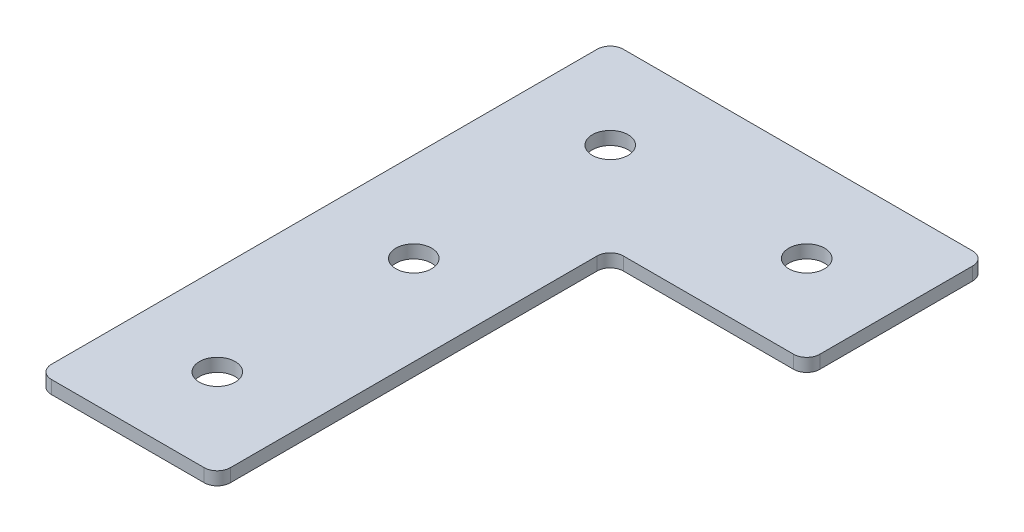
ISO-10303-21;
HEADER;
FILE_DESCRIPTION(('STEP AP214'),'2;1');
FILE_NAME('part.step','',(''),(''),'','','');
FILE_SCHEMA(('AUTOMOTIVE_DESIGN { 1 0 10303 214 1 1 1 1 }'));
ENDSEC;
DATA;
#1=APPLICATION_CONTEXT('core data for automotive mechanical design processes');
#2=APPLICATION_PROTOCOL_DEFINITION('international standard','automotive_design',2000,#1);
#3=PRODUCT_CONTEXT('',#1,'mechanical');
#4=PRODUCT('Part','Part','',(#3));
#5=PRODUCT_RELATED_PRODUCT_CATEGORY('part','',(#4));
#6=PRODUCT_DEFINITION_FORMATION('','',#4);
#7=PRODUCT_DEFINITION_CONTEXT('part definition',#1,'design');
#8=PRODUCT_DEFINITION('design','',#6,#7);
#9=PRODUCT_DEFINITION_SHAPE('','',#8);
#10=(LENGTH_UNIT() NAMED_UNIT(*) SI_UNIT(.MILLI.,.METRE.));
#11=(NAMED_UNIT(*) PLANE_ANGLE_UNIT() SI_UNIT($,.RADIAN.));
#12=(NAMED_UNIT(*) SI_UNIT($,.STERADIAN.) SOLID_ANGLE_UNIT());
#13=UNCERTAINTY_MEASURE_WITH_UNIT(LENGTH_MEASURE(1.E-05),#10,'distance_accuracy_value','');
#14=(GEOMETRIC_REPRESENTATION_CONTEXT(3) GLOBAL_UNCERTAINTY_ASSIGNED_CONTEXT((#13)) GLOBAL_UNIT_ASSIGNED_CONTEXT((#10,
#11,#12)) REPRESENTATION_CONTEXT('',''));
#15=CARTESIAN_POINT('',(0.,0.,0.));
#16=DIRECTION('',(0.,0.,1.));
#17=DIRECTION('',(1.,0.,0.));
#18=AXIS2_PLACEMENT_3D('',#15,#16,#17);
#19=CARTESIAN_POINT('',(-24.170116495859,1.64126526075142,-46.4706382626173));
#20=DIRECTION('',(0.,-1.,0.));
#21=DIRECTION('',(0.,0.,-1.));
#22=AXIS2_PLACEMENT_3D('',#19,#20,#21);
#23=PLANE('',#22);
#24=CARTESIAN_POINT('',(-24.170116495859,1.64126526075142,43.5293617373827));
#25=DIRECTION('',(0.,1.,0.));
#26=DIRECTION('',(0.,0.,1.));
#27=AXIS2_PLACEMENT_3D('',#24,#25,#26);
#28=CIRCLE('',#27,4.1);
#29=CARTESIAN_POINT('',(-24.170116495859,1.64126526075142,47.6293617373827));
#30=VERTEX_POINT('',#29);
#31=EDGE_CURVE('E323',#30,#30,#28,.T.);
#32=ORIENTED_EDGE('',*,*,#31,.T.);
#33=EDGE_LOOP('',(#32));
#34=FACE_BOUND('',#33,.T.);
#35=CARTESIAN_POINT('',(-24.170116495859,1.64126526075142,-1.47063826261726));
#36=DIRECTION('',(0.,1.,0.));
#37=DIRECTION('',(0.,0.,1.));
#38=AXIS2_PLACEMENT_3D('',#35,#36,#37);
#39=CIRCLE('',#38,4.1);
#40=CARTESIAN_POINT('',(-24.170116495859,1.64126526075142,2.62936173738274));
#41=VERTEX_POINT('',#40);
#42=EDGE_CURVE('E319',#41,#41,#39,.T.);
#43=ORIENTED_EDGE('',*,*,#42,.T.);
#44=EDGE_LOOP('',(#43));
#45=FACE_BOUND('',#44,.T.);
#46=CARTESIAN_POINT('',(20.829883504141,1.64126526075142,-46.4706382626172));
#47=DIRECTION('',(0.,1.,0.));
#48=DIRECTION('',(0.,0.,1.));
#49=AXIS2_PLACEMENT_3D('',#46,#47,#48);
#50=CIRCLE('',#49,4.1);
#51=CARTESIAN_POINT('',(20.829883504141,1.64126526075142,-42.3706382626172));
#52=VERTEX_POINT('',#51);
#53=EDGE_CURVE('E313',#52,#52,#50,.T.);
#54=ORIENTED_EDGE('',*,*,#53,.T.);
#55=EDGE_LOOP('',(#54));
#56=FACE_BOUND('',#55,.T.);
#57=CARTESIAN_POINT('',(-24.170116495859,1.64126526075142,-46.4706382626173));
#58=DIRECTION('',(0.,1.,0.));
#59=DIRECTION('',(0.,0.,1.));
#60=AXIS2_PLACEMENT_3D('',#57,#58,#59);
#61=CIRCLE('',#60,4.1);
#62=CARTESIAN_POINT('',(-24.170116495859,1.64126526075142,-42.3706382626173));
#63=VERTEX_POINT('',#62);
#64=EDGE_CURVE('E187',#63,#63,#61,.T.);
#65=ORIENTED_EDGE('',*,*,#64,.T.);
#66=EDGE_LOOP('',(#65));
#67=FACE_BOUND('',#66,.T.);
#68=DIRECTION('',(-1.,0.,0.));
#69=VECTOR('',#68,1.);
#70=CARTESIAN_POINT('',(41.329883504141,1.64126526075142,-66.9706382626173));
#71=LINE('',#70,#69);
#72=CARTESIAN_POINT('',(38.329883504141,1.64126526075142,-66.9706382626173));
#73=VERTEX_POINT('',#72);
#74=CARTESIAN_POINT('',(-41.670116495859,1.64126526075142,-66.9706382626173));
#75=VERTEX_POINT('',#74);
#76=EDGE_CURVE('E208',#73,#75,#71,.T.);
#77=ORIENTED_EDGE('',*,*,#76,.F.);
#78=CARTESIAN_POINT('',(38.329883504141,1.64126526075142,-63.9706382626173));
#79=DIRECTION('',(0.,-1.,0.));
#80=DIRECTION('',(0.,0.,-1.));
#81=AXIS2_PLACEMENT_3D('',#78,#79,#80);
#82=CIRCLE('',#81,3.);
#83=CARTESIAN_POINT('',(41.329883504141,1.64126526075142,-63.9706382626173));
#84=VERTEX_POINT('',#83);
#85=EDGE_CURVE('E159',#73,#84,#82,.T.);
#86=ORIENTED_EDGE('',*,*,#85,.T.);
#87=DIRECTION('',(0.,0.,-1.));
#88=VECTOR('',#87,1.);
#89=CARTESIAN_POINT('',(41.329883504141,1.64126526075142,-25.9706382626172));
#90=LINE('',#89,#88);
#91=CARTESIAN_POINT('',(41.329883504141,1.64126526075142,-28.9706382626172));
#92=VERTEX_POINT('',#91);
#93=EDGE_CURVE('E217',#92,#84,#90,.T.);
#94=ORIENTED_EDGE('',*,*,#93,.F.);
#95=CARTESIAN_POINT('',(38.329883504141,1.64126526075142,-28.9706382626172));
#96=DIRECTION('',(0.,-1.,0.));
#97=DIRECTION('',(0.,0.,-1.));
#98=AXIS2_PLACEMENT_3D('',#95,#96,#97);
#99=CIRCLE('',#98,3.);
#100=CARTESIAN_POINT('',(38.329883504141,1.64126526075142,-25.9706382626172));
#101=VERTEX_POINT('',#100);
#102=EDGE_CURVE('E131',#92,#101,#99,.T.);
#103=ORIENTED_EDGE('',*,*,#102,.T.);
#104=DIRECTION('',(1.,0.,0.));
#105=VECTOR('',#104,1.);
#106=CARTESIAN_POINT('',(-3.67011649585904,1.64126526075142,-25.9706382626172));
#107=LINE('',#106,#105);
#108=CARTESIAN_POINT('',(-0.670116495859043,1.64126526075142,-25.9706382626172));
#109=VERTEX_POINT('',#108);
#110=EDGE_CURVE('E194',#109,#101,#107,.T.);
#111=ORIENTED_EDGE('',*,*,#110,.F.);
#112=CARTESIAN_POINT('',(-0.670116495859043,1.64126526075142,-22.9706382626172));
#113=DIRECTION('',(0.,-1.,0.));
#114=DIRECTION('',(0.,0.,-1.));
#115=AXIS2_PLACEMENT_3D('',#112,#113,#114);
#116=CIRCLE('',#115,3.);
#117=CARTESIAN_POINT('',(-3.67011649585904,1.64126526075142,-22.9706382626172));
#118=VERTEX_POINT('',#117);
#119=EDGE_CURVE('E10',#109,#118,#116,.F.);
#120=ORIENTED_EDGE('',*,*,#119,.T.);
#121=DIRECTION('',(0.,0.,-1.));
#122=VECTOR('',#121,1.);
#123=CARTESIAN_POINT('',(-3.67011649585904,1.64126526075142,64.0293617373827));
#124=LINE('',#123,#122);
#125=CARTESIAN_POINT('',(-3.67011649585904,1.64126526075142,61.0293617373827));
#126=VERTEX_POINT('',#125);
#127=EDGE_CURVE('E132',#126,#118,#124,.T.);
#128=ORIENTED_EDGE('',*,*,#127,.F.);
#129=CARTESIAN_POINT('',(-6.67011649585904,1.64126526075142,61.0293617373827));
#130=DIRECTION('',(0.,-1.,0.));
#131=DIRECTION('',(0.,0.,-1.));
#132=AXIS2_PLACEMENT_3D('',#129,#130,#131);
#133=CIRCLE('',#132,3.);
#134=CARTESIAN_POINT('',(-6.67011649585906,1.64126526075142,64.0293617373827));
#135=VERTEX_POINT('',#134);
#136=EDGE_CURVE('E153',#126,#135,#133,.T.);
#137=ORIENTED_EDGE('',*,*,#136,.T.);
#138=DIRECTION('',(1.,0.,0.));
#139=VECTOR('',#138,1.);
#140=CARTESIAN_POINT('',(-44.670116495859,1.64126526075142,64.0293617373827));
#141=LINE('',#140,#139);
#142=CARTESIAN_POINT('',(-41.670116495859,1.64126526075142,64.0293617373827));
#143=VERTEX_POINT('',#142);
#144=EDGE_CURVE('E136',#143,#135,#141,.T.);
#145=ORIENTED_EDGE('',*,*,#144,.F.);
#146=CARTESIAN_POINT('',(-41.670116495859,1.64126526075142,61.0293617373827));
#147=DIRECTION('',(0.,-1.,0.));
#148=DIRECTION('',(0.,0.,-1.));
#149=AXIS2_PLACEMENT_3D('',#146,#147,#148);
#150=CIRCLE('',#149,3.);
#151=CARTESIAN_POINT('',(-44.670116495859,1.64126526075142,61.0293617373827));
#152=VERTEX_POINT('',#151);
#153=EDGE_CURVE('E31',#143,#152,#150,.T.);
#154=ORIENTED_EDGE('',*,*,#153,.T.);
#155=DIRECTION('',(0.,0.,1.));
#156=VECTOR('',#155,1.);
#157=CARTESIAN_POINT('',(-44.670116495859,1.64126526075142,-66.9706382626173));
#158=LINE('',#157,#156);
#159=CARTESIAN_POINT('',(-44.670116495859,1.64126526075142,-63.9706382626173));
#160=VERTEX_POINT('',#159);
#161=EDGE_CURVE('E206',#160,#152,#158,.T.);
#162=ORIENTED_EDGE('',*,*,#161,.F.);
#163=CARTESIAN_POINT('',(-41.670116495859,1.64126526075142,-63.9706382626173));
#164=DIRECTION('',(0.,-1.,0.));
#165=DIRECTION('',(0.,0.,-1.));
#166=AXIS2_PLACEMENT_3D('',#163,#164,#165);
#167=CIRCLE('',#166,3.);
#168=EDGE_CURVE('E157',#160,#75,#167,.T.);
#169=ORIENTED_EDGE('',*,*,#168,.T.);
#170=EDGE_LOOP('',(#77,#86,#94,#103,#111,#120,#128,#137,#145,#154,#162,#169));
#171=FACE_BOUND('',#170,.T.);
#172=ADVANCED_FACE('F16',(#34,#45,#56,#67,#171),#23,.T.);
#173=CARTESIAN_POINT('',(-3.67011649585904,1.64126526075142,-25.9706382626172));
#174=DIRECTION('',(0.,0.,1.));
#175=DIRECTION('',(1.,0.,0.));
#176=AXIS2_PLACEMENT_3D('',#173,#174,#175);
#177=PLANE('',#176);
#178=DIRECTION('',(1.,0.,0.));
#179=VECTOR('',#178,1.);
#180=CARTESIAN_POINT('',(-3.67011649585904,4.64126526075142,-25.9706382626172));
#181=LINE('',#180,#179);
#182=CARTESIAN_POINT('',(-0.670116495859043,4.64126526075142,-25.9706382626172));
#183=VERTEX_POINT('',#182);
#184=CARTESIAN_POINT('',(38.329883504141,4.64126526075142,-25.9706382626172));
#185=VERTEX_POINT('',#184);
#186=EDGE_CURVE('E111',#183,#185,#181,.T.);
#187=ORIENTED_EDGE('',*,*,#186,.F.);
#188=DIRECTION('',(0.,1.,0.));
#189=VECTOR('',#188,1.);
#190=CARTESIAN_POINT('',(-0.670116495859043,1.64126526075142,-25.9706382626172));
#191=LINE('',#190,#189);
#192=EDGE_CURVE('E177',#183,#109,#191,.F.);
#193=ORIENTED_EDGE('',*,*,#192,.T.);
#194=ORIENTED_EDGE('',*,*,#110,.T.);
#195=DIRECTION('',(0.,1.,0.));
#196=VECTOR('',#195,1.);
#197=CARTESIAN_POINT('',(38.329883504141,1.64126526075142,-25.9706382626172));
#198=LINE('',#197,#196);
#199=EDGE_CURVE('E175',#101,#185,#198,.T.);
#200=ORIENTED_EDGE('',*,*,#199,.T.);
#201=EDGE_LOOP('',(#187,#193,#194,#200));
#202=FACE_BOUND('',#201,.T.);
#203=ADVANCED_FACE('F184',(#202),#177,.T.);
#204=CARTESIAN_POINT('',(-3.67011649585904,1.64126526075142,64.0293617373827));
#205=DIRECTION('',(1.,0.,0.));
#206=DIRECTION('',(0.,0.,-1.));
#207=AXIS2_PLACEMENT_3D('',#204,#205,#206);
#208=PLANE('',#207);
#209=ORIENTED_EDGE('',*,*,#127,.T.);
#210=DIRECTION('',(0.,1.,0.));
#211=VECTOR('',#210,1.);
#212=CARTESIAN_POINT('',(-3.67011649585904,4.64126526075142,-22.9706382626172));
#213=LINE('',#212,#211);
#214=CARTESIAN_POINT('',(-3.67011649585904,4.64126526075142,-22.9706382626172));
#215=VERTEX_POINT('',#214);
#216=EDGE_CURVE('E172',#118,#215,#213,.T.);
#217=ORIENTED_EDGE('',*,*,#216,.T.);
#218=DIRECTION('',(0.,0.,-1.));
#219=VECTOR('',#218,1.);
#220=CARTESIAN_POINT('',(-3.67011649585904,4.64126526075142,64.0293617373827));
#221=LINE('',#220,#219);
#222=CARTESIAN_POINT('',(-3.67011649585904,4.64126526075142,61.0293617373827));
#223=VERTEX_POINT('',#222);
#224=EDGE_CURVE('E139',#223,#215,#221,.T.);
#225=ORIENTED_EDGE('',*,*,#224,.F.);
#226=DIRECTION('',(0.,1.,0.));
#227=VECTOR('',#226,1.);
#228=CARTESIAN_POINT('',(-3.67011649585904,1.64126526075142,61.0293617373827));
#229=LINE('',#228,#227);
#230=EDGE_CURVE('E170',#223,#126,#229,.F.);
#231=ORIENTED_EDGE('',*,*,#230,.T.);
#232=EDGE_LOOP('',(#209,#217,#225,#231));
#233=FACE_BOUND('',#232,.T.);
#234=ADVANCED_FACE('F196',(#233),#208,.T.);
#235=CARTESIAN_POINT('',(-44.670116495859,1.64126526075142,64.0293617373827));
#236=DIRECTION('',(0.,0.,1.));
#237=DIRECTION('',(1.,0.,0.));
#238=AXIS2_PLACEMENT_3D('',#235,#236,#237);
#239=PLANE('',#238);
#240=DIRECTION('',(1.,0.,0.));
#241=VECTOR('',#240,1.);
#242=CARTESIAN_POINT('',(-44.670116495859,4.64126526075142,64.0293617373827));
#243=LINE('',#242,#241);
#244=CARTESIAN_POINT('',(-41.670116495859,4.64126526075142,64.0293617373827));
#245=VERTEX_POINT('',#244);
#246=CARTESIAN_POINT('',(-6.67011649585906,4.64126526075142,64.0293617373827));
#247=VERTEX_POINT('',#246);
#248=EDGE_CURVE('E216',#245,#247,#243,.T.);
#249=ORIENTED_EDGE('',*,*,#248,.F.);
#250=DIRECTION('',(0.,1.,0.));
#251=VECTOR('',#250,1.);
#252=CARTESIAN_POINT('',(-41.670116495859,1.64126526075142,64.0293617373827));
#253=LINE('',#252,#251);
#254=EDGE_CURVE('E168',#245,#143,#253,.F.);
#255=ORIENTED_EDGE('',*,*,#254,.T.);
#256=ORIENTED_EDGE('',*,*,#144,.T.);
#257=DIRECTION('',(0.,1.,0.));
#258=VECTOR('',#257,1.);
#259=CARTESIAN_POINT('',(-6.67011649585904,1.64126526075142,64.0293617373827));
#260=LINE('',#259,#258);
#261=EDGE_CURVE('E165',#135,#247,#260,.T.);
#262=ORIENTED_EDGE('',*,*,#261,.T.);
#263=EDGE_LOOP('',(#249,#255,#256,#262));
#264=FACE_BOUND('',#263,.T.);
#265=ADVANCED_FACE('F203',(#264),#239,.T.);
#266=CARTESIAN_POINT('',(-44.670116495859,1.64126526075142,-66.9706382626173));
#267=DIRECTION('',(-1.,0.,0.));
#268=DIRECTION('',(0.,0.,1.));
#269=AXIS2_PLACEMENT_3D('',#266,#267,#268);
#270=PLANE('',#269);
#271=DIRECTION('',(0.,0.,1.));
#272=VECTOR('',#271,1.);
#273=CARTESIAN_POINT('',(-44.670116495859,4.64126526075142,-66.9706382626173));
#274=LINE('',#273,#272);
#275=CARTESIAN_POINT('',(-44.670116495859,4.64126526075142,-63.9706382626173));
#276=VERTEX_POINT('',#275);
#277=CARTESIAN_POINT('',(-44.670116495859,4.64126526075142,61.0293617373827));
#278=VERTEX_POINT('',#277);
#279=EDGE_CURVE('E214',#276,#278,#274,.T.);
#280=ORIENTED_EDGE('',*,*,#279,.F.);
#281=DIRECTION('',(0.,1.,0.));
#282=VECTOR('',#281,1.);
#283=CARTESIAN_POINT('',(-44.670116495859,1.64126526075142,-63.9706382626173));
#284=LINE('',#283,#282);
#285=EDGE_CURVE('E38',#276,#160,#284,.F.);
#286=ORIENTED_EDGE('',*,*,#285,.T.);
#287=ORIENTED_EDGE('',*,*,#161,.T.);
#288=DIRECTION('',(0.,1.,0.));
#289=VECTOR('',#288,1.);
#290=CARTESIAN_POINT('',(-44.670116495859,1.64126526075142,61.0293617373827));
#291=LINE('',#290,#289);
#292=EDGE_CURVE('E161',#152,#278,#291,.T.);
#293=ORIENTED_EDGE('',*,*,#292,.T.);
#294=EDGE_LOOP('',(#280,#286,#287,#293));
#295=FACE_BOUND('',#294,.T.);
#296=ADVANCED_FACE('F233',(#295),#270,.T.);
#297=CARTESIAN_POINT('',(41.329883504141,1.64126526075142,-66.9706382626173));
#298=DIRECTION('',(0.,0.,-1.));
#299=DIRECTION('',(-1.,0.,0.));
#300=AXIS2_PLACEMENT_3D('',#297,#298,#299);
#301=PLANE('',#300);
#302=DIRECTION('',(-1.,0.,0.));
#303=VECTOR('',#302,1.);
#304=CARTESIAN_POINT('',(41.329883504141,4.64126526075142,-66.9706382626173));
#305=LINE('',#304,#303);
#306=CARTESIAN_POINT('',(38.329883504141,4.64126526075142,-66.9706382626173));
#307=VERTEX_POINT('',#306);
#308=CARTESIAN_POINT('',(-41.670116495859,4.64126526075142,-66.9706382626173));
#309=VERTEX_POINT('',#308);
#310=EDGE_CURVE('E127',#307,#309,#305,.T.);
#311=ORIENTED_EDGE('',*,*,#310,.F.);
#312=DIRECTION('',(0.,1.,0.));
#313=VECTOR('',#312,1.);
#314=CARTESIAN_POINT('',(38.329883504141,1.64126526075142,-66.9706382626173));
#315=LINE('',#314,#313);
#316=EDGE_CURVE('E151',#307,#73,#315,.F.);
#317=ORIENTED_EDGE('',*,*,#316,.T.);
#318=ORIENTED_EDGE('',*,*,#76,.T.);
#319=DIRECTION('',(0.,1.,0.));
#320=VECTOR('',#319,1.);
#321=CARTESIAN_POINT('',(-41.670116495859,1.64126526075142,-66.9706382626173));
#322=LINE('',#321,#320);
#323=EDGE_CURVE('E148',#75,#309,#322,.T.);
#324=ORIENTED_EDGE('',*,*,#323,.T.);
#325=EDGE_LOOP('',(#311,#317,#318,#324));
#326=FACE_BOUND('',#325,.T.);
#327=ADVANCED_FACE('F227',(#326),#301,.T.);
#328=CARTESIAN_POINT('',(41.329883504141,1.64126526075142,-25.9706382626172));
#329=DIRECTION('',(1.,0.,0.));
#330=DIRECTION('',(0.,0.,-1.));
#331=AXIS2_PLACEMENT_3D('',#328,#329,#330);
#332=PLANE('',#331);
#333=ORIENTED_EDGE('',*,*,#93,.T.);
#334=DIRECTION('',(0.,1.,0.));
#335=VECTOR('',#334,1.);
#336=CARTESIAN_POINT('',(41.329883504141,1.64126526075142,-63.9706382626173));
#337=LINE('',#336,#335);
#338=CARTESIAN_POINT('',(41.329883504141,4.64126526075142,-63.9706382626173));
#339=VERTEX_POINT('',#338);
#340=EDGE_CURVE('E126',#84,#339,#337,.T.);
#341=ORIENTED_EDGE('',*,*,#340,.T.);
#342=DIRECTION('',(0.,0.,-1.));
#343=VECTOR('',#342,1.);
#344=CARTESIAN_POINT('',(41.329883504141,4.64126526075142,-25.9706382626172));
#345=LINE('',#344,#343);
#346=CARTESIAN_POINT('',(41.329883504141,4.64126526075142,-28.9706382626172));
#347=VERTEX_POINT('',#346);
#348=EDGE_CURVE('E109',#347,#339,#345,.T.);
#349=ORIENTED_EDGE('',*,*,#348,.F.);
#350=DIRECTION('',(0.,1.,0.));
#351=VECTOR('',#350,1.);
#352=CARTESIAN_POINT('',(41.329883504141,1.64126526075142,-28.9706382626172));
#353=LINE('',#352,#351);
#354=EDGE_CURVE('E123',#347,#92,#353,.F.);
#355=ORIENTED_EDGE('',*,*,#354,.T.);
#356=EDGE_LOOP('',(#333,#341,#349,#355));
#357=FACE_BOUND('',#356,.T.);
#358=ADVANCED_FACE('F122',(#357),#332,.T.);
#359=CARTESIAN_POINT('',(-24.170116495859,4.64126526075142,-46.4706382626173));
#360=DIRECTION('',(0.,-1.,0.));
#361=DIRECTION('',(0.,0.,-1.));
#362=AXIS2_PLACEMENT_3D('',#359,#360,#361);
#363=PLANE('',#362);
#364=CARTESIAN_POINT('',(-24.170116495859,4.64126526075142,43.5293617373827));
#365=DIRECTION('',(0.,1.,0.));
#366=DIRECTION('',(0.,0.,1.));
#367=AXIS2_PLACEMENT_3D('',#364,#365,#366);
#368=CIRCLE('',#367,4.1);
#369=CARTESIAN_POINT('',(-24.170116495859,4.64126526075142,47.6293617373827));
#370=VERTEX_POINT('',#369);
#371=EDGE_CURVE('E301',#370,#370,#368,.T.);
#372=ORIENTED_EDGE('',*,*,#371,.F.);
#373=EDGE_LOOP('',(#372));
#374=FACE_BOUND('',#373,.T.);
#375=CARTESIAN_POINT('',(-24.170116495859,4.64126526075142,-1.47063826261726));
#376=DIRECTION('',(0.,1.,0.));
#377=DIRECTION('',(0.,0.,1.));
#378=AXIS2_PLACEMENT_3D('',#375,#376,#377);
#379=CIRCLE('',#378,4.1);
#380=CARTESIAN_POINT('',(-24.170116495859,4.64126526075142,2.62936173738274));
#381=VERTEX_POINT('',#380);
#382=EDGE_CURVE('E305',#381,#381,#379,.T.);
#383=ORIENTED_EDGE('',*,*,#382,.F.);
#384=EDGE_LOOP('',(#383));
#385=FACE_BOUND('',#384,.T.);
#386=CARTESIAN_POINT('',(20.829883504141,4.64126526075142,-46.4706382626172));
#387=DIRECTION('',(0.,1.,0.));
#388=DIRECTION('',(0.,0.,1.));
#389=AXIS2_PLACEMENT_3D('',#386,#387,#388);
#390=CIRCLE('',#389,4.1);
#391=CARTESIAN_POINT('',(20.829883504141,4.64126526075142,-42.3706382626172));
#392=VERTEX_POINT('',#391);
#393=EDGE_CURVE('E309',#392,#392,#390,.T.);
#394=ORIENTED_EDGE('',*,*,#393,.F.);
#395=EDGE_LOOP('',(#394));
#396=FACE_BOUND('',#395,.T.);
#397=CARTESIAN_POINT('',(-24.170116495859,4.64126526075142,-46.4706382626173));
#398=DIRECTION('',(0.,1.,0.));
#399=DIRECTION('',(0.,0.,1.));
#400=AXIS2_PLACEMENT_3D('',#397,#398,#399);
#401=CIRCLE('',#400,4.1);
#402=CARTESIAN_POINT('',(-24.170116495859,4.64126526075142,-42.3706382626173));
#403=VERTEX_POINT('',#402);
#404=EDGE_CURVE('E221',#403,#403,#401,.T.);
#405=ORIENTED_EDGE('',*,*,#404,.F.);
#406=EDGE_LOOP('',(#405));
#407=FACE_BOUND('',#406,.T.);
#408=ORIENTED_EDGE('',*,*,#348,.T.);
#409=CARTESIAN_POINT('',(38.329883504141,4.64126526075142,-63.9706382626173));
#410=DIRECTION('',(0.,-1.,0.));
#411=DIRECTION('',(0.,0.,-1.));
#412=AXIS2_PLACEMENT_3D('',#409,#410,#411);
#413=CIRCLE('',#412,3.);
#414=EDGE_CURVE('E146',#339,#307,#413,.F.);
#415=ORIENTED_EDGE('',*,*,#414,.T.);
#416=ORIENTED_EDGE('',*,*,#310,.T.);
#417=CARTESIAN_POINT('',(-41.670116495859,4.64126526075142,-63.9706382626173));
#418=DIRECTION('',(0.,-1.,0.));
#419=DIRECTION('',(0.,0.,-1.));
#420=AXIS2_PLACEMENT_3D('',#417,#418,#419);
#421=CIRCLE('',#420,3.);
#422=EDGE_CURVE('E144',#309,#276,#421,.F.);
#423=ORIENTED_EDGE('',*,*,#422,.T.);
#424=ORIENTED_EDGE('',*,*,#279,.T.);
#425=CARTESIAN_POINT('',(-41.670116495859,4.64126526075142,61.0293617373827));
#426=DIRECTION('',(0.,-1.,0.));
#427=DIRECTION('',(0.,0.,-1.));
#428=AXIS2_PLACEMENT_3D('',#425,#426,#427);
#429=CIRCLE('',#428,3.);
#430=EDGE_CURVE('E116',#278,#245,#429,.F.);
#431=ORIENTED_EDGE('',*,*,#430,.T.);
#432=ORIENTED_EDGE('',*,*,#248,.T.);
#433=CARTESIAN_POINT('',(-6.67011649585904,4.64126526075142,61.0293617373827));
#434=DIRECTION('',(0.,-1.,0.));
#435=DIRECTION('',(0.,0.,-1.));
#436=AXIS2_PLACEMENT_3D('',#433,#434,#435);
#437=CIRCLE('',#436,3.);
#438=EDGE_CURVE('E117',#247,#223,#437,.F.);
#439=ORIENTED_EDGE('',*,*,#438,.T.);
#440=ORIENTED_EDGE('',*,*,#224,.T.);
#441=CARTESIAN_POINT('',(-0.670116495859043,4.64126526075142,-22.9706382626172));
#442=DIRECTION('',(0.,-1.,0.));
#443=DIRECTION('',(0.,0.,-1.));
#444=AXIS2_PLACEMENT_3D('',#441,#442,#443);
#445=CIRCLE('',#444,3.);
#446=EDGE_CURVE('E24',#215,#183,#445,.T.);
#447=ORIENTED_EDGE('',*,*,#446,.T.);
#448=ORIENTED_EDGE('',*,*,#186,.T.);
#449=CARTESIAN_POINT('',(38.329883504141,4.64126526075142,-28.9706382626172));
#450=DIRECTION('',(0.,-1.,0.));
#451=DIRECTION('',(0.,0.,-1.));
#452=AXIS2_PLACEMENT_3D('',#449,#450,#451);
#453=CIRCLE('',#452,3.);
#454=EDGE_CURVE('E106',#185,#347,#453,.F.);
#455=ORIENTED_EDGE('',*,*,#454,.T.);
#456=EDGE_LOOP('',(#408,#415,#416,#423,#424,#431,#432,#439,#440,#447,#448,#455));
#457=FACE_BOUND('',#456,.T.);
#458=ADVANCED_FACE('F108',(#374,#385,#396,#407,#457),#363,.F.);
#459=CARTESIAN_POINT('',(-24.170116495859,1.64126526075142,-46.4706382626173));
#460=DIRECTION('',(0.,1.,0.));
#461=DIRECTION('',(0.,0.,1.));
#462=AXIS2_PLACEMENT_3D('',#459,#460,#461);
#463=CYLINDRICAL_SURFACE('',#462,4.1);
#464=ORIENTED_EDGE('',*,*,#64,.F.);
#465=EDGE_LOOP('',(#464));
#466=FACE_BOUND('',#465,.T.);
#467=ORIENTED_EDGE('',*,*,#404,.T.);
#468=EDGE_LOOP('',(#467));
#469=FACE_BOUND('',#468,.T.);
#470=ADVANCED_FACE('F278',(#466,#469),#463,.F.);
#471=CARTESIAN_POINT('',(20.829883504141,1.64126526075142,-46.4706382626172));
#472=DIRECTION('',(0.,1.,0.));
#473=DIRECTION('',(0.,0.,1.));
#474=AXIS2_PLACEMENT_3D('',#471,#472,#473);
#475=CYLINDRICAL_SURFACE('',#474,4.1);
#476=ORIENTED_EDGE('',*,*,#53,.F.);
#477=EDGE_LOOP('',(#476));
#478=FACE_BOUND('',#477,.T.);
#479=ORIENTED_EDGE('',*,*,#393,.T.);
#480=EDGE_LOOP('',(#479));
#481=FACE_BOUND('',#480,.T.);
#482=ADVANCED_FACE('F270',(#478,#481),#475,.F.);
#483=CARTESIAN_POINT('',(-24.170116495859,1.64126526075142,-1.47063826261726));
#484=DIRECTION('',(0.,1.,0.));
#485=DIRECTION('',(0.,0.,1.));
#486=AXIS2_PLACEMENT_3D('',#483,#484,#485);
#487=CYLINDRICAL_SURFACE('',#486,4.1);
#488=ORIENTED_EDGE('',*,*,#42,.F.);
#489=EDGE_LOOP('',(#488));
#490=FACE_BOUND('',#489,.T.);
#491=ORIENTED_EDGE('',*,*,#382,.T.);
#492=EDGE_LOOP('',(#491));
#493=FACE_BOUND('',#492,.T.);
#494=ADVANCED_FACE('F264',(#490,#493),#487,.F.);
#495=CARTESIAN_POINT('',(-24.170116495859,1.64126526075142,43.5293617373827));
#496=DIRECTION('',(0.,1.,0.));
#497=DIRECTION('',(0.,0.,1.));
#498=AXIS2_PLACEMENT_3D('',#495,#496,#497);
#499=CYLINDRICAL_SURFACE('',#498,4.1);
#500=ORIENTED_EDGE('',*,*,#31,.F.);
#501=EDGE_LOOP('',(#500));
#502=FACE_BOUND('',#501,.T.);
#503=ORIENTED_EDGE('',*,*,#371,.T.);
#504=EDGE_LOOP('',(#503));
#505=FACE_BOUND('',#504,.T.);
#506=ADVANCED_FACE('F259',(#502,#505),#499,.F.);
#507=CARTESIAN_POINT('',(38.329883504141,1.64126526075142,-63.9706382626173));
#508=DIRECTION('',(0.,1.,0.));
#509=DIRECTION('',(0.,0.,1.));
#510=AXIS2_PLACEMENT_3D('',#507,#508,#509);
#511=CYLINDRICAL_SURFACE('',#510,3.);
#512=ORIENTED_EDGE('',*,*,#85,.F.);
#513=ORIENTED_EDGE('',*,*,#316,.F.);
#514=ORIENTED_EDGE('',*,*,#414,.F.);
#515=ORIENTED_EDGE('',*,*,#340,.F.);
#516=EDGE_LOOP('',(#512,#513,#514,#515));
#517=FACE_BOUND('',#516,.T.);
#518=ADVANCED_FACE('F245',(#517),#511,.T.);
#519=CARTESIAN_POINT('',(-41.670116495859,1.64126526075142,-63.9706382626173));
#520=DIRECTION('',(0.,1.,0.));
#521=DIRECTION('',(0.,0.,1.));
#522=AXIS2_PLACEMENT_3D('',#519,#520,#521);
#523=CYLINDRICAL_SURFACE('',#522,3.);
#524=ORIENTED_EDGE('',*,*,#168,.F.);
#525=ORIENTED_EDGE('',*,*,#285,.F.);
#526=ORIENTED_EDGE('',*,*,#422,.F.);
#527=ORIENTED_EDGE('',*,*,#323,.F.);
#528=EDGE_LOOP('',(#524,#525,#526,#527));
#529=FACE_BOUND('',#528,.T.);
#530=ADVANCED_FACE('F232',(#529),#523,.T.);
#531=CARTESIAN_POINT('',(-41.670116495859,1.64126526075142,61.0293617373827));
#532=DIRECTION('',(0.,1.,0.));
#533=DIRECTION('',(0.,0.,1.));
#534=AXIS2_PLACEMENT_3D('',#531,#532,#533);
#535=CYLINDRICAL_SURFACE('',#534,3.);
#536=ORIENTED_EDGE('',*,*,#153,.F.);
#537=ORIENTED_EDGE('',*,*,#254,.F.);
#538=ORIENTED_EDGE('',*,*,#430,.F.);
#539=ORIENTED_EDGE('',*,*,#292,.F.);
#540=EDGE_LOOP('',(#536,#537,#538,#539));
#541=FACE_BOUND('',#540,.T.);
#542=ADVANCED_FACE('F236',(#541),#535,.T.);
#543=CARTESIAN_POINT('',(-0.670116495859043,1.64126526075142,-22.9706382626172));
#544=DIRECTION('',(0.,-1.,0.));
#545=DIRECTION('',(0.,0.,-1.));
#546=AXIS2_PLACEMENT_3D('',#543,#544,#545);
#547=CYLINDRICAL_SURFACE('',#546,3.);
#548=ORIENTED_EDGE('',*,*,#119,.F.);
#549=ORIENTED_EDGE('',*,*,#192,.F.);
#550=ORIENTED_EDGE('',*,*,#446,.F.);
#551=ORIENTED_EDGE('',*,*,#216,.F.);
#552=EDGE_LOOP('',(#548,#549,#550,#551));
#553=FACE_BOUND('',#552,.T.);
#554=ADVANCED_FACE('F190',(#553),#547,.F.);
#555=CARTESIAN_POINT('',(38.329883504141,1.64126526075142,-28.9706382626172));
#556=DIRECTION('',(0.,1.,0.));
#557=DIRECTION('',(0.,0.,1.));
#558=AXIS2_PLACEMENT_3D('',#555,#556,#557);
#559=CYLINDRICAL_SURFACE('',#558,3.);
#560=ORIENTED_EDGE('',*,*,#102,.F.);
#561=ORIENTED_EDGE('',*,*,#354,.F.);
#562=ORIENTED_EDGE('',*,*,#454,.F.);
#563=ORIENTED_EDGE('',*,*,#199,.F.);
#564=EDGE_LOOP('',(#560,#561,#562,#563));
#565=FACE_BOUND('',#564,.T.);
#566=ADVANCED_FACE('F130',(#565),#559,.T.);
#567=CARTESIAN_POINT('',(-6.67011649585904,1.64126526075142,61.0293617373827));
#568=DIRECTION('',(0.,1.,0.));
#569=DIRECTION('',(0.,0.,1.));
#570=AXIS2_PLACEMENT_3D('',#567,#568,#569);
#571=CYLINDRICAL_SURFACE('',#570,3.);
#572=ORIENTED_EDGE('',*,*,#136,.F.);
#573=ORIENTED_EDGE('',*,*,#230,.F.);
#574=ORIENTED_EDGE('',*,*,#438,.F.);
#575=ORIENTED_EDGE('',*,*,#261,.F.);
#576=EDGE_LOOP('',(#572,#573,#574,#575));
#577=FACE_BOUND('',#576,.T.);
#578=ADVANCED_FACE('F18',(#577),#571,.T.);
#579=CLOSED_SHELL('',(#172,#203,#234,#265,#296,#327,#358,#458,#470,#482,#494,#506,#518,#530,
#542,#554,#566,#578));
#580=MANIFOLD_SOLID_BREP('B1',#579);
#581=ADVANCED_BREP_SHAPE_REPRESENTATION('',(#18,#580),#14);
#582=SHAPE_DEFINITION_REPRESENTATION(#9,#581);
ENDSEC;
END-ISO-10303-21;
